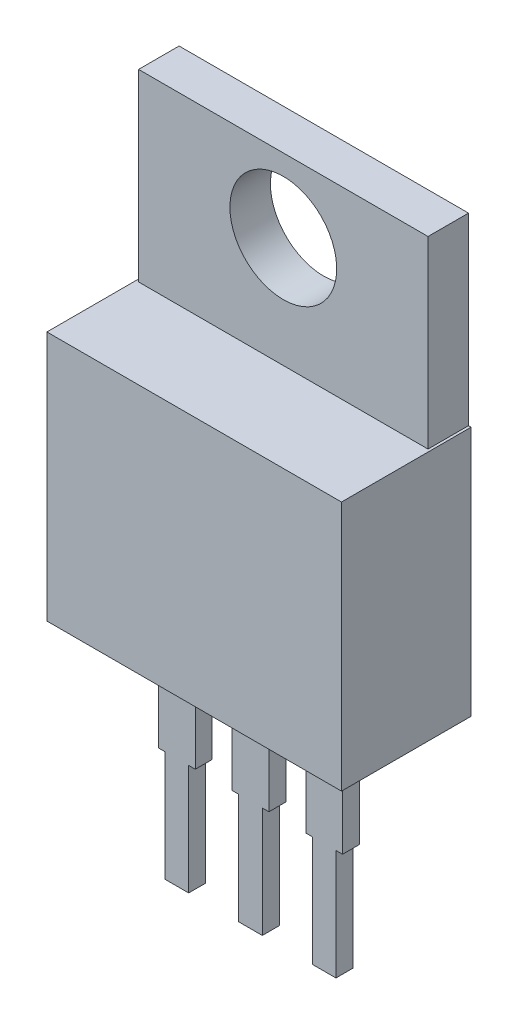
ISO-10303-21;
HEADER;
FILE_DESCRIPTION(('STEP AP214'),'2;1');
FILE_NAME('part.step','',(''),(''),'','','');
FILE_SCHEMA(('AUTOMOTIVE_DESIGN { 1 0 10303 214 1 1 1 1 }'));
ENDSEC;
DATA;
#1=APPLICATION_CONTEXT('core data for automotive mechanical design processes');
#2=APPLICATION_PROTOCOL_DEFINITION('international standard','automotive_design',2000,#1);
#3=PRODUCT_CONTEXT('',#1,'mechanical');
#4=PRODUCT('Part','Part','',(#3));
#5=PRODUCT_RELATED_PRODUCT_CATEGORY('part','',(#4));
#6=PRODUCT_DEFINITION_FORMATION('','',#4);
#7=PRODUCT_DEFINITION_CONTEXT('part definition',#1,'design');
#8=PRODUCT_DEFINITION('design','',#6,#7);
#9=PRODUCT_DEFINITION_SHAPE('','',#8);
#10=(LENGTH_UNIT() NAMED_UNIT(*) SI_UNIT(.MILLI.,.METRE.));
#11=(NAMED_UNIT(*) PLANE_ANGLE_UNIT() SI_UNIT($,.RADIAN.));
#12=(NAMED_UNIT(*) SI_UNIT($,.STERADIAN.) SOLID_ANGLE_UNIT());
#13=UNCERTAINTY_MEASURE_WITH_UNIT(LENGTH_MEASURE(1.E-05),#10,'distance_accuracy_value','');
#14=(GEOMETRIC_REPRESENTATION_CONTEXT(3) GLOBAL_UNCERTAINTY_ASSIGNED_CONTEXT((#13)) GLOBAL_UNIT_ASSIGNED_CONTEXT((#10,
#11,#12)) REPRESENTATION_CONTEXT('',''));
#15=CARTESIAN_POINT('',(0.,0.,0.));
#16=DIRECTION('',(0.,0.,1.));
#17=DIRECTION('',(1.,0.,0.));
#18=AXIS2_PLACEMENT_3D('',#15,#16,#17);
#19=CARTESIAN_POINT('',(-5.49021000000003,8.3185,1.397));
#20=DIRECTION('',(0.,0.,1.));
#21=DIRECTION('',(1.,0.,0.));
#22=AXIS2_PLACEMENT_3D('',#19,#20,#21);
#23=PLANE('',#22);
#24=CARTESIAN_POINT('',(0.,12.446,1.397));
#25=DIRECTION('',(0.,0.,1.));
#26=DIRECTION('',(0.,-1.,0.));
#27=AXIS2_PLACEMENT_3D('',#24,#25,#26);
#28=CIRCLE('',#27,1.8415);
#29=CARTESIAN_POINT('',(0.,10.6045,1.397));
#30=VERTEX_POINT('',#29);
#31=EDGE_CURVE('E21',#30,#30,#28,.T.);
#32=ORIENTED_EDGE('',*,*,#31,.F.);
#33=EDGE_LOOP('',(#32));
#34=FACE_BOUND('',#33,.T.);
#35=DIRECTION('',(1.,0.,0.));
#36=VECTOR('',#35,1.);
#37=CARTESIAN_POINT('',(-5.588,8.636,1.397));
#38=LINE('',#37,#36);
#39=CARTESIAN_POINT('',(4.9911,8.636,1.397));
#40=VERTEX_POINT('',#39);
#41=CARTESIAN_POINT('',(-4.99110000000001,8.636,1.397));
#42=VERTEX_POINT('',#41);
#43=EDGE_CURVE('E311',#40,#42,#38,.F.);
#44=ORIENTED_EDGE('',*,*,#43,.F.);
#45=DIRECTION('',(0.,1.,0.));
#46=VECTOR('',#45,1.);
#47=CARTESIAN_POINT('',(4.9911,8.3185,1.397));
#48=LINE('',#47,#46);
#49=CARTESIAN_POINT('',(4.99109999999999,14.986,1.397));
#50=VERTEX_POINT('',#49);
#51=EDGE_CURVE('E296',#50,#40,#48,.F.);
#52=ORIENTED_EDGE('',*,*,#51,.F.);
#53=DIRECTION('',(1.,0.,0.));
#54=VECTOR('',#53,1.);
#55=CARTESIAN_POINT('',(-5.49021000000003,14.986,1.397));
#56=LINE('',#55,#54);
#57=CARTESIAN_POINT('',(-4.99110000000001,14.986,1.397));
#58=VERTEX_POINT('',#57);
#59=EDGE_CURVE('E295',#58,#50,#56,.T.);
#60=ORIENTED_EDGE('',*,*,#59,.F.);
#61=DIRECTION('',(0.,1.,0.));
#62=VECTOR('',#61,1.);
#63=CARTESIAN_POINT('',(-4.9911,8.3185,1.397));
#64=LINE('',#63,#62);
#65=EDGE_CURVE('E281',#42,#58,#64,.T.);
#66=ORIENTED_EDGE('',*,*,#65,.F.);
#67=EDGE_LOOP('',(#44,#52,#60,#66));
#68=FACE_BOUND('',#67,.T.);
#69=ADVANCED_FACE('F17',(#34,#68),#23,.T.);
#70=CARTESIAN_POINT('',(0.698500000000008,-8.001,1.9431));
#71=DIRECTION('',(0.,0.,-1.));
#72=DIRECTION('',(-1.,0.,0.));
#73=AXIS2_PLACEMENT_3D('',#70,#71,#72);
#74=PLANE('',#73);
#75=DIRECTION('',(-1.,0.,0.));
#76=VECTOR('',#75,1.);
#77=CARTESIAN_POINT('',(0.698500000000008,0.,1.9431));
#78=LINE('',#77,#76);
#79=CARTESIAN_POINT('',(-0.634999999999994,0.,1.9431));
#80=VERTEX_POINT('',#79);
#81=CARTESIAN_POINT('',(0.635000000000005,0.,1.9431));
#82=VERTEX_POINT('',#81);
#83=EDGE_CURVE('E814',#80,#82,#78,.F.);
#84=ORIENTED_EDGE('',*,*,#83,.T.);
#85=DIRECTION('',(0.,1.,0.));
#86=VECTOR('',#85,1.);
#87=CARTESIAN_POINT('',(0.635000000000005,-4.0005,1.9431));
#88=LINE('',#87,#86);
#89=CARTESIAN_POINT('',(0.635000000000006,-3.81,1.9431));
#90=VERTEX_POINT('',#89);
#91=EDGE_CURVE('E340',#90,#82,#88,.T.);
#92=ORIENTED_EDGE('',*,*,#91,.F.);
#93=DIRECTION('',(1.,0.,0.));
#94=VECTOR('',#93,1.);
#95=CARTESIAN_POINT('',(0.39497000000001,-3.81,1.9431));
#96=LINE('',#95,#94);
#97=CARTESIAN_POINT('',(0.40640000000001,-3.81,1.9431));
#98=VERTEX_POINT('',#97);
#99=EDGE_CURVE('E333',#98,#90,#96,.T.);
#100=ORIENTED_EDGE('',*,*,#99,.F.);
#101=DIRECTION('',(0.,1.,0.));
#102=VECTOR('',#101,1.);
#103=CARTESIAN_POINT('',(0.40640000000001,-7.8105,1.9431));
#104=LINE('',#103,#102);
#105=CARTESIAN_POINT('',(0.406400000000011,-7.62,1.9431));
#106=VERTEX_POINT('',#105);
#107=EDGE_CURVE('E328',#106,#98,#104,.T.);
#108=ORIENTED_EDGE('',*,*,#107,.F.);
#109=DIRECTION('',(1.,0.,0.));
#110=VECTOR('',#109,1.);
#111=CARTESIAN_POINT('',(-0.447039999999987,-7.62,1.9431));
#112=LINE('',#111,#110);
#113=CARTESIAN_POINT('',(-0.40639999999999,-7.62,1.9431));
#114=VERTEX_POINT('',#113);
#115=EDGE_CURVE('E323',#114,#106,#112,.T.);
#116=ORIENTED_EDGE('',*,*,#115,.F.);
#117=DIRECTION('',(0.,1.,0.));
#118=VECTOR('',#117,1.);
#119=CARTESIAN_POINT('',(-0.406399999999992,-7.8105,1.9431));
#120=LINE('',#119,#118);
#121=CARTESIAN_POINT('',(-0.406399999999991,-3.81,1.9431));
#122=VERTEX_POINT('',#121);
#123=EDGE_CURVE('E318',#122,#114,#120,.F.);
#124=ORIENTED_EDGE('',*,*,#123,.F.);
#125=DIRECTION('',(1.,0.,0.));
#126=VECTOR('',#125,1.);
#127=CARTESIAN_POINT('',(-0.646429999999992,-3.81,1.9431));
#128=LINE('',#127,#126);
#129=CARTESIAN_POINT('',(-0.634999999999993,-3.81,1.9431));
#130=VERTEX_POINT('',#129);
#131=EDGE_CURVE('E310',#130,#122,#128,.T.);
#132=ORIENTED_EDGE('',*,*,#131,.F.);
#133=DIRECTION('',(0.,1.,0.));
#134=VECTOR('',#133,1.);
#135=CARTESIAN_POINT('',(-0.634999999999995,-4.0005,1.9431));
#136=LINE('',#135,#134);
#137=EDGE_CURVE('E344',#80,#130,#136,.F.);
#138=ORIENTED_EDGE('',*,*,#137,.F.);
#139=EDGE_LOOP('',(#84,#92,#100,#108,#116,#124,#132,#138));
#140=FACE_BOUND('',#139,.T.);
#141=ADVANCED_FACE('F651',(#140),#74,.T.);
#142=CARTESIAN_POINT('',(-1.84149999999999,-8.001,1.9431));
#143=DIRECTION('',(0.,0.,-1.));
#144=DIRECTION('',(-1.,0.,0.));
#145=AXIS2_PLACEMENT_3D('',#142,#143,#144);
#146=PLANE('',#145);
#147=DIRECTION('',(-1.,0.,0.));
#148=VECTOR('',#147,1.);
#149=CARTESIAN_POINT('',(-1.84149999999999,0.,1.9431));
#150=LINE('',#149,#148);
#151=CARTESIAN_POINT('',(-3.175,0.,1.9431));
#152=VERTEX_POINT('',#151);
#153=CARTESIAN_POINT('',(-1.905,0.,1.9431));
#154=VERTEX_POINT('',#153);
#155=EDGE_CURVE('E292',#152,#154,#150,.F.);
#156=ORIENTED_EDGE('',*,*,#155,.T.);
#157=DIRECTION('',(0.,1.,0.));
#158=VECTOR('',#157,1.);
#159=CARTESIAN_POINT('',(-1.905,-4.0005,1.9431));
#160=LINE('',#159,#158);
#161=CARTESIAN_POINT('',(-1.90499999999999,-3.81,1.9431));
#162=VERTEX_POINT('',#161);
#163=EDGE_CURVE('E376',#162,#154,#160,.T.);
#164=ORIENTED_EDGE('',*,*,#163,.F.);
#165=DIRECTION('',(1.,0.,0.));
#166=VECTOR('',#165,1.);
#167=CARTESIAN_POINT('',(-2.14502999999999,-3.81,1.9431));
#168=LINE('',#167,#166);
#169=CARTESIAN_POINT('',(-2.13359999999999,-3.81,1.9431));
#170=VERTEX_POINT('',#169);
#171=EDGE_CURVE('E369',#170,#162,#168,.T.);
#172=ORIENTED_EDGE('',*,*,#171,.F.);
#173=DIRECTION('',(0.,1.,0.));
#174=VECTOR('',#173,1.);
#175=CARTESIAN_POINT('',(-2.13359999999999,-7.8105,1.9431));
#176=LINE('',#175,#174);
#177=CARTESIAN_POINT('',(-2.13359999999999,-7.62,1.9431));
#178=VERTEX_POINT('',#177);
#179=EDGE_CURVE('E364',#178,#170,#176,.T.);
#180=ORIENTED_EDGE('',*,*,#179,.F.);
#181=DIRECTION('',(1.,0.,0.));
#182=VECTOR('',#181,1.);
#183=CARTESIAN_POINT('',(-2.98704,-7.62,1.9431));
#184=LINE('',#183,#182);
#185=CARTESIAN_POINT('',(-2.9464,-7.62,1.9431));
#186=VERTEX_POINT('',#185);
#187=EDGE_CURVE('E359',#186,#178,#184,.T.);
#188=ORIENTED_EDGE('',*,*,#187,.F.);
#189=DIRECTION('',(0.,1.,0.));
#190=VECTOR('',#189,1.);
#191=CARTESIAN_POINT('',(-2.9464,-7.8105,1.9431));
#192=LINE('',#191,#190);
#193=CARTESIAN_POINT('',(-2.9464,-3.81,1.9431));
#194=VERTEX_POINT('',#193);
#195=EDGE_CURVE('E354',#194,#186,#192,.F.);
#196=ORIENTED_EDGE('',*,*,#195,.F.);
#197=DIRECTION('',(1.,0.,0.));
#198=VECTOR('',#197,1.);
#199=CARTESIAN_POINT('',(-3.18643,-3.81,1.9431));
#200=LINE('',#199,#198);
#201=CARTESIAN_POINT('',(-3.175,-3.81,1.9431));
#202=VERTEX_POINT('',#201);
#203=EDGE_CURVE('E347',#202,#194,#200,.T.);
#204=ORIENTED_EDGE('',*,*,#203,.F.);
#205=DIRECTION('',(0.,1.,0.));
#206=VECTOR('',#205,1.);
#207=CARTESIAN_POINT('',(-3.175,-4.0005,1.9431));
#208=LINE('',#207,#206);
#209=EDGE_CURVE('E380',#152,#202,#208,.F.);
#210=ORIENTED_EDGE('',*,*,#209,.F.);
#211=EDGE_LOOP('',(#156,#164,#172,#180,#188,#196,#204,#210));
#212=FACE_BOUND('',#211,.T.);
#213=ADVANCED_FACE('F648',(#212),#146,.T.);
#214=CARTESIAN_POINT('',(-4.9911,8.3185,-0.0698499999999995));
#215=DIRECTION('',(-1.,0.,0.));
#216=DIRECTION('',(0.,0.,1.));
#217=AXIS2_PLACEMENT_3D('',#214,#215,#216);
#218=PLANE('',#217);
#219=DIRECTION('',(0.,0.,1.));
#220=VECTOR('',#219,1.);
#221=CARTESIAN_POINT('',(-4.9911,8.636,-0.223520000000001));
#222=LINE('',#221,#220);
#223=CARTESIAN_POINT('',(-4.9911,8.636,0.));
#224=VERTEX_POINT('',#223);
#225=EDGE_CURVE('E288',#42,#224,#222,.F.);
#226=ORIENTED_EDGE('',*,*,#225,.F.);
#227=ORIENTED_EDGE('',*,*,#65,.T.);
#228=DIRECTION('',(0.,0.,1.));
#229=VECTOR('',#228,1.);
#230=CARTESIAN_POINT('',(-4.99110000000003,14.986,-0.0698500000000013));
#231=LINE('',#230,#229);
#232=CARTESIAN_POINT('',(-4.99110000000001,14.986,0.));
#233=VERTEX_POINT('',#232);
#234=EDGE_CURVE('E286',#233,#58,#231,.T.);
#235=ORIENTED_EDGE('',*,*,#234,.F.);
#236=DIRECTION('',(0.,1.,0.));
#237=VECTOR('',#236,1.);
#238=CARTESIAN_POINT('',(-4.9911,-0.749300000000005,0.));
#239=LINE('',#238,#237);
#240=EDGE_CURVE('E402',#224,#233,#239,.T.);
#241=ORIENTED_EDGE('',*,*,#240,.F.);
#242=EDGE_LOOP('',(#226,#227,#235,#241));
#243=FACE_BOUND('',#242,.T.);
#244=ADVANCED_FACE('F283',(#243),#218,.T.);
#245=CARTESIAN_POINT('',(-5.49021000000003,14.986,-0.0698500000000013));
#246=DIRECTION('',(0.,1.,0.));
#247=DIRECTION('',(0.,0.,1.));
#248=AXIS2_PLACEMENT_3D('',#245,#246,#247);
#249=PLANE('',#248);
#250=DIRECTION('',(0.,0.,-1.));
#251=VECTOR('',#250,1.);
#252=CARTESIAN_POINT('',(4.9911,14.986,1.46685));
#253=LINE('',#252,#251);
#254=CARTESIAN_POINT('',(4.99109999999998,14.986,0.));
#255=VERTEX_POINT('',#254);
#256=EDGE_CURVE('E299',#255,#50,#253,.F.);
#257=ORIENTED_EDGE('',*,*,#256,.F.);
#258=DIRECTION('',(-1.,0.,0.));
#259=VECTOR('',#258,1.);
#260=CARTESIAN_POINT('',(5.588,14.986,0.));
#261=LINE('',#260,#259);
#262=EDGE_CURVE('E303',#233,#255,#261,.F.);
#263=ORIENTED_EDGE('',*,*,#262,.F.);
#264=ORIENTED_EDGE('',*,*,#234,.T.);
#265=ORIENTED_EDGE('',*,*,#59,.T.);
#266=EDGE_LOOP('',(#257,#263,#264,#265));
#267=FACE_BOUND('',#266,.T.);
#268=ADVANCED_FACE('F301',(#267),#249,.T.);
#269=CARTESIAN_POINT('',(4.9911,8.3185,1.46685));
#270=DIRECTION('',(1.,0.,0.));
#271=DIRECTION('',(0.,0.,-1.));
#272=AXIS2_PLACEMENT_3D('',#269,#270,#271);
#273=PLANE('',#272);
#274=DIRECTION('',(0.,0.,1.));
#275=VECTOR('',#274,1.);
#276=CARTESIAN_POINT('',(4.9911,8.636,-0.223520000000001));
#277=LINE('',#276,#275);
#278=CARTESIAN_POINT('',(4.9911,8.636,0.));
#279=VERTEX_POINT('',#278);
#280=EDGE_CURVE('E313',#279,#40,#277,.T.);
#281=ORIENTED_EDGE('',*,*,#280,.F.);
#282=DIRECTION('',(0.,1.,0.));
#283=VECTOR('',#282,1.);
#284=CARTESIAN_POINT('',(4.99109999999998,-0.749300000000005,0.));
#285=LINE('',#284,#283);
#286=EDGE_CURVE('E399',#255,#279,#285,.F.);
#287=ORIENTED_EDGE('',*,*,#286,.F.);
#288=ORIENTED_EDGE('',*,*,#256,.T.);
#289=ORIENTED_EDGE('',*,*,#51,.T.);
#290=EDGE_LOOP('',(#281,#287,#288,#289));
#291=FACE_BOUND('',#290,.T.);
#292=ADVANCED_FACE('F522',(#291),#273,.T.);
#293=CARTESIAN_POINT('',(0.,12.446,0.));
#294=DIRECTION('',(0.,0.,1.));
#295=DIRECTION('',(0.,-1.,0.));
#296=AXIS2_PLACEMENT_3D('',#293,#294,#295);
#297=CYLINDRICAL_SURFACE('',#296,1.8415);
#298=ORIENTED_EDGE('',*,*,#31,.T.);
#299=EDGE_LOOP('',(#298));
#300=FACE_BOUND('',#299,.T.);
#301=CARTESIAN_POINT('',(0.,12.446,0.));
#302=DIRECTION('',(0.,0.,1.));
#303=DIRECTION('',(0.,-1.,0.));
#304=AXIS2_PLACEMENT_3D('',#301,#302,#303);
#305=CIRCLE('',#304,1.8415);
#306=CARTESIAN_POINT('',(0.,10.6045,0.));
#307=VERTEX_POINT('',#306);
#308=EDGE_CURVE('E397',#307,#307,#305,.T.);
#309=ORIENTED_EDGE('',*,*,#308,.F.);
#310=EDGE_LOOP('',(#309));
#311=FACE_BOUND('',#310,.T.);
#312=ADVANCED_FACE('F19',(#300,#311),#297,.F.);
#313=CARTESIAN_POINT('',(-5.588,8.636,-0.223520000000001));
#314=DIRECTION('',(0.,1.,0.));
#315=DIRECTION('',(0.,0.,1.));
#316=AXIS2_PLACEMENT_3D('',#313,#314,#315);
#317=PLANE('',#316);
#318=DIRECTION('',(0.,0.,-1.));
#319=VECTOR('',#318,1.);
#320=CARTESIAN_POINT('',(5.08,8.636,4.69392));
#321=LINE('',#320,#319);
#322=CARTESIAN_POINT('',(5.08,8.636,0.));
#323=VERTEX_POINT('',#322);
#324=CARTESIAN_POINT('',(5.08,8.636,4.4704));
#325=VERTEX_POINT('',#324);
#326=EDGE_CURVE('E406',#323,#325,#321,.F.);
#327=ORIENTED_EDGE('',*,*,#326,.F.);
#328=DIRECTION('',(-1.,0.,0.));
#329=VECTOR('',#328,1.);
#330=CARTESIAN_POINT('',(5.588,8.636,0.));
#331=LINE('',#330,#329);
#332=EDGE_CURVE('E201',#279,#323,#331,.F.);
#333=ORIENTED_EDGE('',*,*,#332,.F.);
#334=ORIENTED_EDGE('',*,*,#280,.T.);
#335=ORIENTED_EDGE('',*,*,#43,.T.);
#336=ORIENTED_EDGE('',*,*,#225,.T.);
#337=DIRECTION('',(-1.,0.,0.));
#338=VECTOR('',#337,1.);
#339=CARTESIAN_POINT('',(5.588,8.636,0.));
#340=LINE('',#339,#338);
#341=CARTESIAN_POINT('',(-5.08,8.636,0.));
#342=VERTEX_POINT('',#341);
#343=EDGE_CURVE('E391',#342,#224,#340,.F.);
#344=ORIENTED_EDGE('',*,*,#343,.F.);
#345=DIRECTION('',(0.,0.,1.));
#346=VECTOR('',#345,1.);
#347=CARTESIAN_POINT('',(-5.08,8.636,-0.22352));
#348=LINE('',#347,#346);
#349=CARTESIAN_POINT('',(-5.08,8.636,4.4704));
#350=VERTEX_POINT('',#349);
#351=EDGE_CURVE('E388',#350,#342,#348,.F.);
#352=ORIENTED_EDGE('',*,*,#351,.F.);
#353=DIRECTION('',(1.,0.,0.));
#354=VECTOR('',#353,1.);
#355=CARTESIAN_POINT('',(-5.588,8.636,4.4704));
#356=LINE('',#355,#354);
#357=EDGE_CURVE('E383',#325,#350,#356,.F.);
#358=ORIENTED_EDGE('',*,*,#357,.F.);
#359=EDGE_LOOP('',(#327,#333,#334,#335,#336,#344,#352,#358));
#360=FACE_BOUND('',#359,.T.);
#361=ADVANCED_FACE('F521',(#360),#317,.T.);
#362=CARTESIAN_POINT('',(-0.646429999999992,-3.81,2.55651));
#363=DIRECTION('',(0.,-1.,0.));
#364=DIRECTION('',(0.,0.,-1.));
#365=AXIS2_PLACEMENT_3D('',#362,#363,#364);
#366=PLANE('',#365);
#367=DIRECTION('',(0.,0.,1.));
#368=VECTOR('',#367,1.);
#369=CARTESIAN_POINT('',(-0.634999999999995,-3.81,1.91389));
#370=LINE('',#369,#368);
#371=CARTESIAN_POINT('',(-0.634999999999994,-3.81,2.5273));
#372=VERTEX_POINT('',#371);
#373=EDGE_CURVE('E339',#130,#372,#370,.T.);
#374=ORIENTED_EDGE('',*,*,#373,.F.);
#375=ORIENTED_EDGE('',*,*,#131,.T.);
#376=DIRECTION('',(0.,0.,1.));
#377=VECTOR('',#376,1.);
#378=CARTESIAN_POINT('',(-0.406399999999992,-3.81,1.91389));
#379=LINE('',#378,#377);
#380=CARTESIAN_POINT('',(-0.406399999999992,-3.81,2.5273));
#381=VERTEX_POINT('',#380);
#382=EDGE_CURVE('E317',#381,#122,#379,.F.);
#383=ORIENTED_EDGE('',*,*,#382,.F.);
#384=DIRECTION('',(1.,0.,0.));
#385=VECTOR('',#384,1.);
#386=CARTESIAN_POINT('',(-0.698499999999995,-3.81,2.5273));
#387=LINE('',#386,#385);
#388=EDGE_CURVE('E195',#372,#381,#387,.T.);
#389=ORIENTED_EDGE('',*,*,#388,.F.);
#390=EDGE_LOOP('',(#374,#375,#383,#389));
#391=FACE_BOUND('',#390,.T.);
#392=ADVANCED_FACE('F529',(#391),#366,.T.);
#393=CARTESIAN_POINT('',(-0.406399999999992,-7.8105,1.91389));
#394=DIRECTION('',(-1.,0.,0.));
#395=DIRECTION('',(0.,0.,1.));
#396=AXIS2_PLACEMENT_3D('',#393,#394,#395);
#397=PLANE('',#396);
#398=ORIENTED_EDGE('',*,*,#382,.T.);
#399=ORIENTED_EDGE('',*,*,#123,.T.);
#400=DIRECTION('',(0.,0.,-1.));
#401=VECTOR('',#400,1.);
#402=CARTESIAN_POINT('',(-0.406399999999987,-7.62,2.55651));
#403=LINE('',#402,#401);
#404=CARTESIAN_POINT('',(-0.406399999999991,-7.62,2.5273));
#405=VERTEX_POINT('',#404);
#406=EDGE_CURVE('E320',#405,#114,#403,.T.);
#407=ORIENTED_EDGE('',*,*,#406,.F.);
#408=DIRECTION('',(0.,1.,0.));
#409=VECTOR('',#408,1.);
#410=CARTESIAN_POINT('',(-0.406399999999992,-8.001,2.5273));
#411=LINE('',#410,#409);
#412=EDGE_CURVE('E429',#381,#405,#411,.F.);
#413=ORIENTED_EDGE('',*,*,#412,.F.);
#414=EDGE_LOOP('',(#398,#399,#407,#413));
#415=FACE_BOUND('',#414,.T.);
#416=ADVANCED_FACE('F637',(#415),#397,.T.);
#417=CARTESIAN_POINT('',(-0.447039999999987,-7.62,2.55651));
#418=DIRECTION('',(0.,-1.,0.));
#419=DIRECTION('',(0.,0.,-1.));
#420=AXIS2_PLACEMENT_3D('',#417,#418,#419);
#421=PLANE('',#420);
#422=ORIENTED_EDGE('',*,*,#115,.T.);
#423=DIRECTION('',(0.,0.,-1.));
#424=VECTOR('',#423,1.);
#425=CARTESIAN_POINT('',(0.40640000000001,-7.62,2.55651));
#426=LINE('',#425,#424);
#427=CARTESIAN_POINT('',(0.406400000000012,-7.62,2.5273));
#428=VERTEX_POINT('',#427);
#429=EDGE_CURVE('E325',#428,#106,#426,.T.);
#430=ORIENTED_EDGE('',*,*,#429,.F.);
#431=DIRECTION('',(1.,0.,0.));
#432=VECTOR('',#431,1.);
#433=CARTESIAN_POINT('',(-0.698499999999995,-7.62,2.5273));
#434=LINE('',#433,#432);
#435=EDGE_CURVE('E426',#405,#428,#434,.T.);
#436=ORIENTED_EDGE('',*,*,#435,.F.);
#437=ORIENTED_EDGE('',*,*,#406,.T.);
#438=EDGE_LOOP('',(#422,#430,#436,#437));
#439=FACE_BOUND('',#438,.T.);
#440=ADVANCED_FACE('F633',(#439),#421,.T.);
#441=CARTESIAN_POINT('',(0.40640000000001,-7.8105,2.55651));
#442=DIRECTION('',(1.,0.,0.));
#443=DIRECTION('',(0.,0.,-1.));
#444=AXIS2_PLACEMENT_3D('',#441,#442,#443);
#445=PLANE('',#444);
#446=DIRECTION('',(0.,0.,-1.));
#447=VECTOR('',#446,1.);
#448=CARTESIAN_POINT('',(0.40640000000001,-3.81,2.55651));
#449=LINE('',#448,#447);
#450=CARTESIAN_POINT('',(0.406400000000011,-3.81,2.5273));
#451=VERTEX_POINT('',#450);
#452=EDGE_CURVE('E330',#451,#98,#449,.T.);
#453=ORIENTED_EDGE('',*,*,#452,.F.);
#454=DIRECTION('',(0.,1.,0.));
#455=VECTOR('',#454,1.);
#456=CARTESIAN_POINT('',(0.406400000000013,-8.001,2.5273));
#457=LINE('',#456,#455);
#458=EDGE_CURVE('E423',#428,#451,#457,.T.);
#459=ORIENTED_EDGE('',*,*,#458,.F.);
#460=ORIENTED_EDGE('',*,*,#429,.T.);
#461=ORIENTED_EDGE('',*,*,#107,.T.);
#462=EDGE_LOOP('',(#453,#459,#460,#461));
#463=FACE_BOUND('',#462,.T.);
#464=ADVANCED_FACE('F630',(#463),#445,.T.);
#465=CARTESIAN_POINT('',(0.39497000000001,-3.81,2.55651));
#466=DIRECTION('',(0.,-1.,0.));
#467=DIRECTION('',(0.,0.,-1.));
#468=AXIS2_PLACEMENT_3D('',#465,#466,#467);
#469=PLANE('',#468);
#470=DIRECTION('',(0.,0.,-1.));
#471=VECTOR('',#470,1.);
#472=CARTESIAN_POINT('',(0.635000000000005,-3.81,2.55651));
#473=LINE('',#472,#471);
#474=CARTESIAN_POINT('',(0.635000000000007,-3.81,2.5273));
#475=VERTEX_POINT('',#474);
#476=EDGE_CURVE('E175',#475,#90,#473,.T.);
#477=ORIENTED_EDGE('',*,*,#476,.F.);
#478=DIRECTION('',(1.,0.,0.));
#479=VECTOR('',#478,1.);
#480=CARTESIAN_POINT('',(-0.698499999999995,-3.81,2.5273));
#481=LINE('',#480,#479);
#482=EDGE_CURVE('E420',#451,#475,#481,.T.);
#483=ORIENTED_EDGE('',*,*,#482,.F.);
#484=ORIENTED_EDGE('',*,*,#452,.T.);
#485=ORIENTED_EDGE('',*,*,#99,.T.);
#486=EDGE_LOOP('',(#477,#483,#484,#485));
#487=FACE_BOUND('',#486,.T.);
#488=ADVANCED_FACE('F626',(#487),#469,.T.);
#489=CARTESIAN_POINT('',(0.635000000000005,-4.0005,2.55651));
#490=DIRECTION('',(1.,0.,0.));
#491=DIRECTION('',(0.,0.,-1.));
#492=AXIS2_PLACEMENT_3D('',#489,#490,#491);
#493=PLANE('',#492);
#494=DIRECTION('',(0.,0.,-1.));
#495=VECTOR('',#494,1.);
#496=CARTESIAN_POINT('',(0.635000000000005,0.,2.55651));
#497=LINE('',#496,#495);
#498=CARTESIAN_POINT('',(0.635000000000006,0.,2.5273));
#499=VERTEX_POINT('',#498);
#500=EDGE_CURVE('E337',#82,#499,#497,.F.);
#501=ORIENTED_EDGE('',*,*,#500,.T.);
#502=DIRECTION('',(0.,1.,0.));
#503=VECTOR('',#502,1.);
#504=CARTESIAN_POINT('',(0.635000000000008,-8.001,2.5273));
#505=LINE('',#504,#503);
#506=EDGE_CURVE('E417',#475,#499,#505,.T.);
#507=ORIENTED_EDGE('',*,*,#506,.F.);
#508=ORIENTED_EDGE('',*,*,#476,.T.);
#509=ORIENTED_EDGE('',*,*,#91,.T.);
#510=EDGE_LOOP('',(#501,#507,#508,#509));
#511=FACE_BOUND('',#510,.T.);
#512=ADVANCED_FACE('F622',(#511),#493,.T.);
#513=CARTESIAN_POINT('',(-0.634999999999995,-4.0005,1.91389));
#514=DIRECTION('',(-1.,0.,0.));
#515=DIRECTION('',(0.,0.,1.));
#516=AXIS2_PLACEMENT_3D('',#513,#514,#515);
#517=PLANE('',#516);
#518=DIRECTION('',(0.,0.,1.));
#519=VECTOR('',#518,1.);
#520=CARTESIAN_POINT('',(-0.634999999999995,0.,1.91389));
#521=LINE('',#520,#519);
#522=CARTESIAN_POINT('',(-0.634999999999995,0.,2.5273));
#523=VERTEX_POINT('',#522);
#524=EDGE_CURVE('E348',#523,#80,#521,.F.);
#525=ORIENTED_EDGE('',*,*,#524,.T.);
#526=ORIENTED_EDGE('',*,*,#137,.T.);
#527=ORIENTED_EDGE('',*,*,#373,.T.);
#528=DIRECTION('',(0.,1.,0.));
#529=VECTOR('',#528,1.);
#530=CARTESIAN_POINT('',(-0.634999999999995,-8.001,2.5273));
#531=LINE('',#530,#529);
#532=EDGE_CURVE('E414',#523,#372,#531,.F.);
#533=ORIENTED_EDGE('',*,*,#532,.F.);
#534=EDGE_LOOP('',(#525,#526,#527,#533));
#535=FACE_BOUND('',#534,.T.);
#536=ADVANCED_FACE('F619',(#535),#517,.T.);
#537=CARTESIAN_POINT('',(-3.18643,-3.81,2.55651));
#538=DIRECTION('',(0.,-1.,0.));
#539=DIRECTION('',(0.,0.,-1.));
#540=AXIS2_PLACEMENT_3D('',#537,#538,#539);
#541=PLANE('',#540);
#542=DIRECTION('',(0.,0.,1.));
#543=VECTOR('',#542,1.);
#544=CARTESIAN_POINT('',(-3.175,-3.81,1.91389));
#545=LINE('',#544,#543);
#546=CARTESIAN_POINT('',(-3.175,-3.81,2.5273));
#547=VERTEX_POINT('',#546);
#548=EDGE_CURVE('E375',#202,#547,#545,.T.);
#549=ORIENTED_EDGE('',*,*,#548,.F.);
#550=ORIENTED_EDGE('',*,*,#203,.T.);
#551=DIRECTION('',(0.,0.,1.));
#552=VECTOR('',#551,1.);
#553=CARTESIAN_POINT('',(-2.9464,-3.81,1.91389));
#554=LINE('',#553,#552);
#555=CARTESIAN_POINT('',(-2.9464,-3.81,2.5273));
#556=VERTEX_POINT('',#555);
#557=EDGE_CURVE('E353',#556,#194,#554,.F.);
#558=ORIENTED_EDGE('',*,*,#557,.F.);
#559=DIRECTION('',(1.,0.,0.));
#560=VECTOR('',#559,1.);
#561=CARTESIAN_POINT('',(-3.2385,-3.81,2.5273));
#562=LINE('',#561,#560);
#563=EDGE_CURVE('E166',#547,#556,#562,.T.);
#564=ORIENTED_EDGE('',*,*,#563,.F.);
#565=EDGE_LOOP('',(#549,#550,#558,#564));
#566=FACE_BOUND('',#565,.T.);
#567=ADVANCED_FACE('F615',(#566),#541,.T.);
#568=CARTESIAN_POINT('',(-2.9464,-7.8105,1.91389));
#569=DIRECTION('',(-1.,0.,0.));
#570=DIRECTION('',(0.,0.,1.));
#571=AXIS2_PLACEMENT_3D('',#568,#569,#570);
#572=PLANE('',#571);
#573=ORIENTED_EDGE('',*,*,#557,.T.);
#574=ORIENTED_EDGE('',*,*,#195,.T.);
#575=DIRECTION('',(0.,0.,-1.));
#576=VECTOR('',#575,1.);
#577=CARTESIAN_POINT('',(-2.9464,-7.62,2.55651));
#578=LINE('',#577,#576);
#579=CARTESIAN_POINT('',(-2.9464,-7.62,2.5273));
#580=VERTEX_POINT('',#579);
#581=EDGE_CURVE('E356',#580,#186,#578,.T.);
#582=ORIENTED_EDGE('',*,*,#581,.F.);
#583=DIRECTION('',(0.,1.,0.));
#584=VECTOR('',#583,1.);
#585=CARTESIAN_POINT('',(-2.9464,-8.001,2.5273));
#586=LINE('',#585,#584);
#587=EDGE_CURVE('E449',#556,#580,#586,.F.);
#588=ORIENTED_EDGE('',*,*,#587,.F.);
#589=EDGE_LOOP('',(#573,#574,#582,#588));
#590=FACE_BOUND('',#589,.T.);
#591=ADVANCED_FACE('F611',(#590),#572,.T.);
#592=CARTESIAN_POINT('',(-2.98704,-7.62,2.55651));
#593=DIRECTION('',(0.,-1.,0.));
#594=DIRECTION('',(0.,0.,-1.));
#595=AXIS2_PLACEMENT_3D('',#592,#593,#594);
#596=PLANE('',#595);
#597=ORIENTED_EDGE('',*,*,#187,.T.);
#598=DIRECTION('',(0.,0.,-1.));
#599=VECTOR('',#598,1.);
#600=CARTESIAN_POINT('',(-2.13359999999999,-7.62,2.55651));
#601=LINE('',#600,#599);
#602=CARTESIAN_POINT('',(-2.13359999999999,-7.62,2.5273));
#603=VERTEX_POINT('',#602);
#604=EDGE_CURVE('E361',#603,#178,#601,.T.);
#605=ORIENTED_EDGE('',*,*,#604,.F.);
#606=DIRECTION('',(1.,0.,0.));
#607=VECTOR('',#606,1.);
#608=CARTESIAN_POINT('',(-3.2385,-7.62,2.5273));
#609=LINE('',#608,#607);
#610=EDGE_CURVE('E446',#580,#603,#609,.T.);
#611=ORIENTED_EDGE('',*,*,#610,.F.);
#612=ORIENTED_EDGE('',*,*,#581,.T.);
#613=EDGE_LOOP('',(#597,#605,#611,#612));
#614=FACE_BOUND('',#613,.T.);
#615=ADVANCED_FACE('F607',(#614),#596,.T.);
#616=CARTESIAN_POINT('',(-2.13359999999999,-7.8105,2.55651));
#617=DIRECTION('',(1.,0.,0.));
#618=DIRECTION('',(0.,0.,-1.));
#619=AXIS2_PLACEMENT_3D('',#616,#617,#618);
#620=PLANE('',#619);
#621=DIRECTION('',(0.,0.,-1.));
#622=VECTOR('',#621,1.);
#623=CARTESIAN_POINT('',(-2.13359999999999,-3.81,2.55651));
#624=LINE('',#623,#622);
#625=CARTESIAN_POINT('',(-2.13359999999999,-3.81,2.5273));
#626=VERTEX_POINT('',#625);
#627=EDGE_CURVE('E366',#626,#170,#624,.T.);
#628=ORIENTED_EDGE('',*,*,#627,.F.);
#629=DIRECTION('',(0.,1.,0.));
#630=VECTOR('',#629,1.);
#631=CARTESIAN_POINT('',(-2.13359999999999,-8.001,2.5273));
#632=LINE('',#631,#630);
#633=EDGE_CURVE('E443',#603,#626,#632,.T.);
#634=ORIENTED_EDGE('',*,*,#633,.F.);
#635=ORIENTED_EDGE('',*,*,#604,.T.);
#636=ORIENTED_EDGE('',*,*,#179,.T.);
#637=EDGE_LOOP('',(#628,#634,#635,#636));
#638=FACE_BOUND('',#637,.T.);
#639=ADVANCED_FACE('F604',(#638),#620,.T.);
#640=CARTESIAN_POINT('',(-2.14502999999999,-3.81,2.55651));
#641=DIRECTION('',(0.,-1.,0.));
#642=DIRECTION('',(0.,0.,-1.));
#643=AXIS2_PLACEMENT_3D('',#640,#641,#642);
#644=PLANE('',#643);
#645=DIRECTION('',(0.,0.,-1.));
#646=VECTOR('',#645,1.);
#647=CARTESIAN_POINT('',(-1.905,-3.81,2.55651));
#648=LINE('',#647,#646);
#649=CARTESIAN_POINT('',(-1.90499999999999,-3.81,2.5273));
#650=VERTEX_POINT('',#649);
#651=EDGE_CURVE('E146',#650,#162,#648,.T.);
#652=ORIENTED_EDGE('',*,*,#651,.F.);
#653=DIRECTION('',(1.,0.,0.));
#654=VECTOR('',#653,1.);
#655=CARTESIAN_POINT('',(-3.2385,-3.81,2.5273));
#656=LINE('',#655,#654);
#657=EDGE_CURVE('E440',#626,#650,#656,.T.);
#658=ORIENTED_EDGE('',*,*,#657,.F.);
#659=ORIENTED_EDGE('',*,*,#627,.T.);
#660=ORIENTED_EDGE('',*,*,#171,.T.);
#661=EDGE_LOOP('',(#652,#658,#659,#660));
#662=FACE_BOUND('',#661,.T.);
#663=ADVANCED_FACE('F600',(#662),#644,.T.);
#664=CARTESIAN_POINT('',(-1.905,-4.0005,2.55651));
#665=DIRECTION('',(1.,0.,0.));
#666=DIRECTION('',(0.,0.,-1.));
#667=AXIS2_PLACEMENT_3D('',#664,#665,#666);
#668=PLANE('',#667);
#669=DIRECTION('',(0.,0.,-1.));
#670=VECTOR('',#669,1.);
#671=CARTESIAN_POINT('',(-1.905,0.,2.55651));
#672=LINE('',#671,#670);
#673=CARTESIAN_POINT('',(-1.90499999999999,0.,2.5273));
#674=VERTEX_POINT('',#673);
#675=EDGE_CURVE('E373',#154,#674,#672,.F.);
#676=ORIENTED_EDGE('',*,*,#675,.T.);
#677=DIRECTION('',(0.,1.,0.));
#678=VECTOR('',#677,1.);
#679=CARTESIAN_POINT('',(-1.90499999999999,-8.001,2.5273));
#680=LINE('',#679,#678);
#681=EDGE_CURVE('E437',#650,#674,#680,.T.);
#682=ORIENTED_EDGE('',*,*,#681,.F.);
#683=ORIENTED_EDGE('',*,*,#651,.T.);
#684=ORIENTED_EDGE('',*,*,#163,.T.);
#685=EDGE_LOOP('',(#676,#682,#683,#684));
#686=FACE_BOUND('',#685,.T.);
#687=ADVANCED_FACE('F596',(#686),#668,.T.);
#688=CARTESIAN_POINT('',(-3.175,-4.0005,1.91389));
#689=DIRECTION('',(-1.,0.,0.));
#690=DIRECTION('',(0.,0.,1.));
#691=AXIS2_PLACEMENT_3D('',#688,#689,#690);
#692=PLANE('',#691);
#693=DIRECTION('',(0.,0.,1.));
#694=VECTOR('',#693,1.);
#695=CARTESIAN_POINT('',(-3.175,0.,1.91389));
#696=LINE('',#695,#694);
#697=CARTESIAN_POINT('',(-3.175,0.,2.5273));
#698=VERTEX_POINT('',#697);
#699=EDGE_CURVE('E111',#698,#152,#696,.F.);
#700=ORIENTED_EDGE('',*,*,#699,.T.);
#701=ORIENTED_EDGE('',*,*,#209,.T.);
#702=ORIENTED_EDGE('',*,*,#548,.T.);
#703=DIRECTION('',(0.,1.,0.));
#704=VECTOR('',#703,1.);
#705=CARTESIAN_POINT('',(-3.175,-8.001,2.5273));
#706=LINE('',#705,#704);
#707=EDGE_CURVE('E433',#698,#547,#706,.F.);
#708=ORIENTED_EDGE('',*,*,#707,.F.);
#709=EDGE_LOOP('',(#700,#701,#702,#708));
#710=FACE_BOUND('',#709,.T.);
#711=ADVANCED_FACE('F593',(#710),#692,.T.);
#712=CARTESIAN_POINT('',(-5.588,-0.431800000000005,4.4704));
#713=DIRECTION('',(0.,0.,1.));
#714=DIRECTION('',(1.,0.,0.));
#715=AXIS2_PLACEMENT_3D('',#712,#713,#714);
#716=PLANE('',#715);
#717=DIRECTION('',(0.,1.,0.));
#718=VECTOR('',#717,1.);
#719=CARTESIAN_POINT('',(-5.08,-0.431800000000005,4.4704));
#720=LINE('',#719,#718);
#721=CARTESIAN_POINT('',(-5.08,0.,4.4704));
#722=VERTEX_POINT('',#721);
#723=EDGE_CURVE('E387',#722,#350,#720,.T.);
#724=ORIENTED_EDGE('',*,*,#723,.F.);
#725=DIRECTION('',(1.,0.,0.));
#726=VECTOR('',#725,1.);
#727=CARTESIAN_POINT('',(-5.588,0.,4.4704));
#728=LINE('',#727,#726);
#729=CARTESIAN_POINT('',(5.08,0.,4.4704));
#730=VERTEX_POINT('',#729);
#731=EDGE_CURVE('E137',#730,#722,#728,.F.);
#732=ORIENTED_EDGE('',*,*,#731,.F.);
#733=DIRECTION('',(0.,1.,0.));
#734=VECTOR('',#733,1.);
#735=CARTESIAN_POINT('',(5.08,-0.431799999999997,4.4704));
#736=LINE('',#735,#734);
#737=EDGE_CURVE('E412',#325,#730,#736,.F.);
#738=ORIENTED_EDGE('',*,*,#737,.F.);
#739=ORIENTED_EDGE('',*,*,#357,.T.);
#740=EDGE_LOOP('',(#724,#732,#738,#739));
#741=FACE_BOUND('',#740,.T.);
#742=ADVANCED_FACE('F589',(#741),#716,.T.);
#743=CARTESIAN_POINT('',(-5.08,-0.431800000000005,-0.22352));
#744=DIRECTION('',(-1.,0.,0.));
#745=DIRECTION('',(0.,0.,1.));
#746=AXIS2_PLACEMENT_3D('',#743,#744,#745);
#747=PLANE('',#746);
#748=DIRECTION('',(0.,1.,0.));
#749=VECTOR('',#748,1.);
#750=CARTESIAN_POINT('',(-5.08,-0.749300000000005,0.));
#751=LINE('',#750,#749);
#752=CARTESIAN_POINT('',(-5.08,0.,0.));
#753=VERTEX_POINT('',#752);
#754=EDGE_CURVE('E394',#753,#342,#751,.T.);
#755=ORIENTED_EDGE('',*,*,#754,.F.);
#756=DIRECTION('',(0.,0.,-1.));
#757=VECTOR('',#756,1.);
#758=CARTESIAN_POINT('',(-5.08,0.,4.69392));
#759=LINE('',#758,#757);
#760=EDGE_CURVE('E467',#722,#753,#759,.T.);
#761=ORIENTED_EDGE('',*,*,#760,.F.);
#762=ORIENTED_EDGE('',*,*,#723,.T.);
#763=ORIENTED_EDGE('',*,*,#351,.T.);
#764=EDGE_LOOP('',(#755,#761,#762,#763));
#765=FACE_BOUND('',#764,.T.);
#766=ADVANCED_FACE('F586',(#765),#747,.T.);
#767=CARTESIAN_POINT('',(5.588,-0.749300000000005,0.));
#768=DIRECTION('',(0.,0.,-1.));
#769=DIRECTION('',(-1.,0.,0.));
#770=AXIS2_PLACEMENT_3D('',#767,#768,#769);
#771=PLANE('',#770);
#772=ORIENTED_EDGE('',*,*,#308,.T.);
#773=EDGE_LOOP('',(#772));
#774=FACE_BOUND('',#773,.T.);
#775=DIRECTION('',(1.,0.,0.));
#776=VECTOR('',#775,1.);
#777=CARTESIAN_POINT('',(-5.588,0.,0.));
#778=LINE('',#777,#776);
#779=CARTESIAN_POINT('',(5.08,0.,0.));
#780=VERTEX_POINT('',#779);
#781=EDGE_CURVE('E464',#753,#780,#778,.T.);
#782=ORIENTED_EDGE('',*,*,#781,.F.);
#783=ORIENTED_EDGE('',*,*,#754,.T.);
#784=ORIENTED_EDGE('',*,*,#343,.T.);
#785=ORIENTED_EDGE('',*,*,#240,.T.);
#786=ORIENTED_EDGE('',*,*,#262,.T.);
#787=ORIENTED_EDGE('',*,*,#286,.T.);
#788=ORIENTED_EDGE('',*,*,#332,.T.);
#789=DIRECTION('',(0.,1.,0.));
#790=VECTOR('',#789,1.);
#791=CARTESIAN_POINT('',(5.08,-0.431799999999997,0.));
#792=LINE('',#791,#790);
#793=EDGE_CURVE('E409',#780,#323,#792,.T.);
#794=ORIENTED_EDGE('',*,*,#793,.F.);
#795=EDGE_LOOP('',(#782,#783,#784,#785,#786,#787,#788,#794));
#796=FACE_BOUND('',#795,.T.);
#797=ADVANCED_FACE('F518',(#774,#796),#771,.T.);
#798=CARTESIAN_POINT('',(5.08,-0.431799999999997,4.69392));
#799=DIRECTION('',(1.,0.,0.));
#800=DIRECTION('',(0.,0.,-1.));
#801=AXIS2_PLACEMENT_3D('',#798,#799,#800);
#802=PLANE('',#801);
#803=ORIENTED_EDGE('',*,*,#793,.T.);
#804=ORIENTED_EDGE('',*,*,#326,.T.);
#805=ORIENTED_EDGE('',*,*,#737,.T.);
#806=DIRECTION('',(0.,0.,-1.));
#807=VECTOR('',#806,1.);
#808=CARTESIAN_POINT('',(5.08,0.,4.69392));
#809=LINE('',#808,#807);
#810=EDGE_CURVE('E461',#780,#730,#809,.F.);
#811=ORIENTED_EDGE('',*,*,#810,.F.);
#812=EDGE_LOOP('',(#803,#804,#805,#811));
#813=FACE_BOUND('',#812,.T.);
#814=ADVANCED_FACE('F579',(#813),#802,.T.);
#815=CARTESIAN_POINT('',(-0.698499999999995,-8.001,2.5273));
#816=DIRECTION('',(0.,0.,1.));
#817=DIRECTION('',(1.,0.,0.));
#818=AXIS2_PLACEMENT_3D('',#815,#816,#817);
#819=PLANE('',#818);
#820=DIRECTION('',(1.,0.,0.));
#821=VECTOR('',#820,1.);
#822=CARTESIAN_POINT('',(-5.588,0.,2.5273));
#823=LINE('',#822,#821);
#824=EDGE_CURVE('E457',#523,#499,#823,.T.);
#825=ORIENTED_EDGE('',*,*,#824,.F.);
#826=ORIENTED_EDGE('',*,*,#532,.T.);
#827=ORIENTED_EDGE('',*,*,#388,.T.);
#828=ORIENTED_EDGE('',*,*,#412,.T.);
#829=ORIENTED_EDGE('',*,*,#435,.T.);
#830=ORIENTED_EDGE('',*,*,#458,.T.);
#831=ORIENTED_EDGE('',*,*,#482,.T.);
#832=ORIENTED_EDGE('',*,*,#506,.T.);
#833=EDGE_LOOP('',(#825,#826,#827,#828,#829,#830,#831,#832));
#834=FACE_BOUND('',#833,.T.);
#835=ADVANCED_FACE('F575',(#834),#819,.T.);
#836=CARTESIAN_POINT('',(-3.2385,-8.001,2.5273));
#837=DIRECTION('',(0.,0.,1.));
#838=DIRECTION('',(1.,0.,0.));
#839=AXIS2_PLACEMENT_3D('',#836,#837,#838);
#840=PLANE('',#839);
#841=DIRECTION('',(1.,0.,0.));
#842=VECTOR('',#841,1.);
#843=CARTESIAN_POINT('',(-5.588,0.,2.5273));
#844=LINE('',#843,#842);
#845=EDGE_CURVE('E454',#698,#674,#844,.T.);
#846=ORIENTED_EDGE('',*,*,#845,.F.);
#847=ORIENTED_EDGE('',*,*,#707,.T.);
#848=ORIENTED_EDGE('',*,*,#563,.T.);
#849=ORIENTED_EDGE('',*,*,#587,.T.);
#850=ORIENTED_EDGE('',*,*,#610,.T.);
#851=ORIENTED_EDGE('',*,*,#633,.T.);
#852=ORIENTED_EDGE('',*,*,#657,.T.);
#853=ORIENTED_EDGE('',*,*,#681,.T.);
#854=EDGE_LOOP('',(#846,#847,#848,#849,#850,#851,#852,#853));
#855=FACE_BOUND('',#854,.T.);
#856=ADVANCED_FACE('F572',(#855),#840,.T.);
#857=CARTESIAN_POINT('',(1.89357000000001,-3.81,2.55651));
#858=DIRECTION('',(0.,-1.,0.));
#859=DIRECTION('',(0.,0.,-1.));
#860=AXIS2_PLACEMENT_3D('',#857,#858,#859);
#861=PLANE('',#860);
#862=DIRECTION('',(0.,0.,1.));
#863=VECTOR('',#862,1.);
#864=CARTESIAN_POINT('',(1.90500000000001,-3.81,1.91389));
#865=LINE('',#864,#863);
#866=CARTESIAN_POINT('',(1.90500000000001,-3.81,1.9431));
#867=VERTEX_POINT('',#866);
#868=CARTESIAN_POINT('',(1.90500000000001,-3.81,2.5273));
#869=VERTEX_POINT('',#868);
#870=EDGE_CURVE('E456',#867,#869,#865,.T.);
#871=ORIENTED_EDGE('',*,*,#870,.F.);
#872=DIRECTION('',(-1.,0.,0.));
#873=VECTOR('',#872,1.);
#874=CARTESIAN_POINT('',(3.2385,-3.81,1.9431));
#875=LINE('',#874,#873);
#876=CARTESIAN_POINT('',(2.13360000000001,-3.81,1.9431));
#877=VERTEX_POINT('',#876);
#878=EDGE_CURVE('E482',#877,#867,#875,.T.);
#879=ORIENTED_EDGE('',*,*,#878,.F.);
#880=DIRECTION('',(0.,0.,1.));
#881=VECTOR('',#880,1.);
#882=CARTESIAN_POINT('',(2.13360000000001,-3.81,1.91389));
#883=LINE('',#882,#881);
#884=CARTESIAN_POINT('',(2.13360000000001,-3.81,2.5273));
#885=VERTEX_POINT('',#884);
#886=EDGE_CURVE('E436',#885,#877,#883,.F.);
#887=ORIENTED_EDGE('',*,*,#886,.F.);
#888=DIRECTION('',(1.,0.,0.));
#889=VECTOR('',#888,1.);
#890=CARTESIAN_POINT('',(1.84150000000001,-3.81,2.5273));
#891=LINE('',#890,#889);
#892=EDGE_CURVE('E77',#869,#885,#891,.T.);
#893=ORIENTED_EDGE('',*,*,#892,.F.);
#894=EDGE_LOOP('',(#871,#879,#887,#893));
#895=FACE_BOUND('',#894,.T.);
#896=ADVANCED_FACE('F568',(#895),#861,.T.);
#897=CARTESIAN_POINT('',(2.13360000000001,-7.8105,1.91389));
#898=DIRECTION('',(-1.,0.,0.));
#899=DIRECTION('',(0.,0.,1.));
#900=AXIS2_PLACEMENT_3D('',#897,#898,#899);
#901=PLANE('',#900);
#902=ORIENTED_EDGE('',*,*,#886,.T.);
#903=DIRECTION('',(0.,1.,0.));
#904=VECTOR('',#903,1.);
#905=CARTESIAN_POINT('',(2.13360000000001,-8.001,1.9431));
#906=LINE('',#905,#904);
#907=CARTESIAN_POINT('',(2.13360000000001,-7.62,1.9431));
#908=VERTEX_POINT('',#907);
#909=EDGE_CURVE('E485',#908,#877,#906,.T.);
#910=ORIENTED_EDGE('',*,*,#909,.F.);
#911=DIRECTION('',(0.,0.,-1.));
#912=VECTOR('',#911,1.);
#913=CARTESIAN_POINT('',(2.13360000000001,-7.62,2.55651));
#914=LINE('',#913,#912);
#915=CARTESIAN_POINT('',(2.13360000000001,-7.62,2.5273));
#916=VERTEX_POINT('',#915);
#917=EDGE_CURVE('E102',#916,#908,#914,.T.);
#918=ORIENTED_EDGE('',*,*,#917,.F.);
#919=DIRECTION('',(0.,1.,0.));
#920=VECTOR('',#919,1.);
#921=CARTESIAN_POINT('',(2.13360000000001,-8.001,2.5273));
#922=LINE('',#921,#920);
#923=EDGE_CURVE('E506',#885,#916,#922,.F.);
#924=ORIENTED_EDGE('',*,*,#923,.F.);
#925=EDGE_LOOP('',(#902,#910,#918,#924));
#926=FACE_BOUND('',#925,.T.);
#927=ADVANCED_FACE('F564',(#926),#901,.T.);
#928=CARTESIAN_POINT('',(3.175,-4.0005,2.55651));
#929=DIRECTION('',(1.,0.,0.));
#930=DIRECTION('',(0.,0.,-1.));
#931=AXIS2_PLACEMENT_3D('',#928,#929,#930);
#932=PLANE('',#931);
#933=DIRECTION('',(0.,0.,-1.));
#934=VECTOR('',#933,1.);
#935=CARTESIAN_POINT('',(3.175,0.,4.69392));
#936=LINE('',#935,#934);
#937=CARTESIAN_POINT('',(3.175,0.,2.5273));
#938=VERTEX_POINT('',#937);
#939=CARTESIAN_POINT('',(3.175,0.,1.9431));
#940=VERTEX_POINT('',#939);
#941=EDGE_CURVE('E89',#938,#940,#936,.T.);
#942=ORIENTED_EDGE('',*,*,#941,.F.);
#943=DIRECTION('',(0.,1.,0.));
#944=VECTOR('',#943,1.);
#945=CARTESIAN_POINT('',(3.175,-8.001,2.5273));
#946=LINE('',#945,#944);
#947=CARTESIAN_POINT('',(3.175,-3.81,2.5273));
#948=VERTEX_POINT('',#947);
#949=EDGE_CURVE('E500',#948,#938,#946,.T.);
#950=ORIENTED_EDGE('',*,*,#949,.F.);
#951=DIRECTION('',(0.,0.,-1.));
#952=VECTOR('',#951,1.);
#953=CARTESIAN_POINT('',(3.175,-3.81,2.55651));
#954=LINE('',#953,#952);
#955=CARTESIAN_POINT('',(3.175,-3.81,1.9431));
#956=VERTEX_POINT('',#955);
#957=EDGE_CURVE('E490',#956,#948,#954,.F.);
#958=ORIENTED_EDGE('',*,*,#957,.F.);
#959=DIRECTION('',(0.,1.,0.));
#960=VECTOR('',#959,1.);
#961=CARTESIAN_POINT('',(3.175,-8.001,1.9431));
#962=LINE('',#961,#960);
#963=EDGE_CURVE('E84',#940,#956,#962,.F.);
#964=ORIENTED_EDGE('',*,*,#963,.F.);
#965=EDGE_LOOP('',(#942,#950,#958,#964));
#966=FACE_BOUND('',#965,.T.);
#967=ADVANCED_FACE('F561',(#966),#932,.T.);
#968=CARTESIAN_POINT('',(-5.588,0.,4.69392));
#969=DIRECTION('',(0.,-1.,0.));
#970=DIRECTION('',(0.,0.,-1.));
#971=AXIS2_PLACEMENT_3D('',#968,#969,#970);
#972=PLANE('',#971);
#973=ORIENTED_EDGE('',*,*,#699,.F.);
#974=ORIENTED_EDGE('',*,*,#845,.T.);
#975=ORIENTED_EDGE('',*,*,#675,.F.);
#976=ORIENTED_EDGE('',*,*,#155,.F.);
#977=EDGE_LOOP('',(#973,#974,#975,#976));
#978=FACE_BOUND('',#977,.T.);
#979=ORIENTED_EDGE('',*,*,#524,.F.);
#980=ORIENTED_EDGE('',*,*,#824,.T.);
#981=ORIENTED_EDGE('',*,*,#500,.F.);
#982=ORIENTED_EDGE('',*,*,#83,.F.);
#983=EDGE_LOOP('',(#979,#980,#981,#982));
#984=FACE_BOUND('',#983,.T.);
#985=DIRECTION('',(0.,0.,1.));
#986=VECTOR('',#985,1.);
#987=CARTESIAN_POINT('',(1.90500000000001,0.,1.91389));
#988=LINE('',#987,#986);
#989=CARTESIAN_POINT('',(1.90500000000001,0.,2.5273));
#990=VERTEX_POINT('',#989);
#991=CARTESIAN_POINT('',(1.90500000000001,0.,1.9431));
#992=VERTEX_POINT('',#991);
#993=EDGE_CURVE('E59',#990,#992,#988,.F.);
#994=ORIENTED_EDGE('',*,*,#993,.F.);
#995=DIRECTION('',(1.,0.,0.));
#996=VECTOR('',#995,1.);
#997=CARTESIAN_POINT('',(1.84150000000001,0.,2.5273));
#998=LINE('',#997,#996);
#999=EDGE_CURVE('E497',#938,#990,#998,.F.);
#1000=ORIENTED_EDGE('',*,*,#999,.F.);
#1001=ORIENTED_EDGE('',*,*,#941,.T.);
#1002=DIRECTION('',(-1.,0.,0.));
#1003=VECTOR('',#1002,1.);
#1004=CARTESIAN_POINT('',(3.2385,0.,1.9431));
#1005=LINE('',#1004,#1003);
#1006=EDGE_CURVE('E477',#992,#940,#1005,.F.);
#1007=ORIENTED_EDGE('',*,*,#1006,.F.);
#1008=EDGE_LOOP('',(#994,#1000,#1001,#1007));
#1009=FACE_BOUND('',#1008,.T.);
#1010=ORIENTED_EDGE('',*,*,#781,.T.);
#1011=ORIENTED_EDGE('',*,*,#810,.T.);
#1012=ORIENTED_EDGE('',*,*,#731,.T.);
#1013=ORIENTED_EDGE('',*,*,#760,.T.);
#1014=EDGE_LOOP('',(#1010,#1011,#1012,#1013));
#1015=FACE_BOUND('',#1014,.T.);
#1016=ADVANCED_FACE('F557',(#978,#984,#1009,#1015),#972,.T.);
#1017=CARTESIAN_POINT('',(1.90500000000001,-4.0005,1.91389));
#1018=DIRECTION('',(-1.,0.,0.));
#1019=DIRECTION('',(0.,0.,1.));
#1020=AXIS2_PLACEMENT_3D('',#1017,#1018,#1019);
#1021=PLANE('',#1020);
#1022=ORIENTED_EDGE('',*,*,#993,.T.);
#1023=DIRECTION('',(0.,1.,0.));
#1024=VECTOR('',#1023,1.);
#1025=CARTESIAN_POINT('',(1.90500000000001,-8.001,1.9431));
#1026=LINE('',#1025,#1024);
#1027=EDGE_CURVE('E479',#867,#992,#1026,.T.);
#1028=ORIENTED_EDGE('',*,*,#1027,.F.);
#1029=ORIENTED_EDGE('',*,*,#870,.T.);
#1030=DIRECTION('',(0.,1.,0.));
#1031=VECTOR('',#1030,1.);
#1032=CARTESIAN_POINT('',(1.90500000000001,-8.001,2.5273));
#1033=LINE('',#1032,#1031);
#1034=EDGE_CURVE('E494',#990,#869,#1033,.F.);
#1035=ORIENTED_EDGE('',*,*,#1034,.F.);
#1036=EDGE_LOOP('',(#1022,#1028,#1029,#1035));
#1037=FACE_BOUND('',#1036,.T.);
#1038=ADVANCED_FACE('F554',(#1037),#1021,.T.);
#1039=CARTESIAN_POINT('',(2.09296000000001,-7.62,2.55651));
#1040=DIRECTION('',(0.,-1.,0.));
#1041=DIRECTION('',(0.,0.,-1.));
#1042=AXIS2_PLACEMENT_3D('',#1039,#1040,#1041);
#1043=PLANE('',#1042);
#1044=DIRECTION('',(-1.,0.,0.));
#1045=VECTOR('',#1044,1.);
#1046=CARTESIAN_POINT('',(3.2385,-7.62,1.9431));
#1047=LINE('',#1046,#1045);
#1048=CARTESIAN_POINT('',(2.9464,-7.62,1.9431));
#1049=VERTEX_POINT('',#1048);
#1050=EDGE_CURVE('E474',#1049,#908,#1047,.T.);
#1051=ORIENTED_EDGE('',*,*,#1050,.F.);
#1052=DIRECTION('',(0.,0.,-1.));
#1053=VECTOR('',#1052,1.);
#1054=CARTESIAN_POINT('',(2.9464,-7.62,2.55651));
#1055=LINE('',#1054,#1053);
#1056=CARTESIAN_POINT('',(2.9464,-7.62,2.5273));
#1057=VERTEX_POINT('',#1056);
#1058=EDGE_CURVE('E50',#1057,#1049,#1055,.T.);
#1059=ORIENTED_EDGE('',*,*,#1058,.F.);
#1060=DIRECTION('',(1.,0.,0.));
#1061=VECTOR('',#1060,1.);
#1062=CARTESIAN_POINT('',(1.84150000000001,-7.62,2.5273));
#1063=LINE('',#1062,#1061);
#1064=EDGE_CURVE('E504',#916,#1057,#1063,.T.);
#1065=ORIENTED_EDGE('',*,*,#1064,.F.);
#1066=ORIENTED_EDGE('',*,*,#917,.T.);
#1067=EDGE_LOOP('',(#1051,#1059,#1065,#1066));
#1068=FACE_BOUND('',#1067,.T.);
#1069=ADVANCED_FACE('F551',(#1068),#1043,.T.);
#1070=CARTESIAN_POINT('',(3.2385,-8.001,1.9431));
#1071=DIRECTION('',(0.,0.,-1.));
#1072=DIRECTION('',(-1.,0.,0.));
#1073=AXIS2_PLACEMENT_3D('',#1070,#1071,#1072);
#1074=PLANE('',#1073);
#1075=ORIENTED_EDGE('',*,*,#1006,.T.);
#1076=ORIENTED_EDGE('',*,*,#963,.T.);
#1077=DIRECTION('',(1.,0.,0.));
#1078=VECTOR('',#1077,1.);
#1079=CARTESIAN_POINT('',(2.93497,-3.81,1.9431));
#1080=LINE('',#1079,#1078);
#1081=CARTESIAN_POINT('',(2.9464,-3.81,1.9431));
#1082=VERTEX_POINT('',#1081);
#1083=EDGE_CURVE('E476',#1082,#956,#1080,.T.);
#1084=ORIENTED_EDGE('',*,*,#1083,.F.);
#1085=DIRECTION('',(0.,1.,0.));
#1086=VECTOR('',#1085,1.);
#1087=CARTESIAN_POINT('',(2.9464,-7.8105,1.9431));
#1088=LINE('',#1087,#1086);
#1089=EDGE_CURVE('E512',#1049,#1082,#1088,.T.);
#1090=ORIENTED_EDGE('',*,*,#1089,.F.);
#1091=ORIENTED_EDGE('',*,*,#1050,.T.);
#1092=ORIENTED_EDGE('',*,*,#909,.T.);
#1093=ORIENTED_EDGE('',*,*,#878,.T.);
#1094=ORIENTED_EDGE('',*,*,#1027,.T.);
#1095=EDGE_LOOP('',(#1075,#1076,#1084,#1090,#1091,#1092,#1093,#1094));
#1096=FACE_BOUND('',#1095,.T.);
#1097=ADVANCED_FACE('F548',(#1096),#1074,.T.);
#1098=CARTESIAN_POINT('',(2.93497,-3.81,2.55651));
#1099=DIRECTION('',(0.,-1.,0.));
#1100=DIRECTION('',(0.,0.,-1.));
#1101=AXIS2_PLACEMENT_3D('',#1098,#1099,#1100);
#1102=PLANE('',#1101);
#1103=ORIENTED_EDGE('',*,*,#957,.T.);
#1104=DIRECTION('',(1.,0.,0.));
#1105=VECTOR('',#1104,1.);
#1106=CARTESIAN_POINT('',(1.84150000000001,-3.81,2.5273));
#1107=LINE('',#1106,#1105);
#1108=CARTESIAN_POINT('',(2.9464,-3.81,2.5273));
#1109=VERTEX_POINT('',#1108);
#1110=EDGE_CURVE('E36',#1109,#948,#1107,.T.);
#1111=ORIENTED_EDGE('',*,*,#1110,.F.);
#1112=DIRECTION('',(0.,0.,-1.));
#1113=VECTOR('',#1112,1.);
#1114=CARTESIAN_POINT('',(2.9464,-3.81,2.55651));
#1115=LINE('',#1114,#1113);
#1116=EDGE_CURVE('E27',#1082,#1109,#1115,.F.);
#1117=ORIENTED_EDGE('',*,*,#1116,.F.);
#1118=ORIENTED_EDGE('',*,*,#1083,.T.);
#1119=EDGE_LOOP('',(#1103,#1111,#1117,#1118));
#1120=FACE_BOUND('',#1119,.T.);
#1121=ADVANCED_FACE('F542',(#1120),#1102,.T.);
#1122=CARTESIAN_POINT('',(1.84150000000001,-8.001,2.5273));
#1123=DIRECTION('',(0.,0.,1.));
#1124=DIRECTION('',(1.,0.,0.));
#1125=AXIS2_PLACEMENT_3D('',#1122,#1123,#1124);
#1126=PLANE('',#1125);
#1127=ORIENTED_EDGE('',*,*,#999,.T.);
#1128=ORIENTED_EDGE('',*,*,#1034,.T.);
#1129=ORIENTED_EDGE('',*,*,#892,.T.);
#1130=ORIENTED_EDGE('',*,*,#923,.T.);
#1131=ORIENTED_EDGE('',*,*,#1064,.T.);
#1132=DIRECTION('',(0.,1.,0.));
#1133=VECTOR('',#1132,1.);
#1134=CARTESIAN_POINT('',(2.9464,-7.8105,2.5273));
#1135=LINE('',#1134,#1133);
#1136=EDGE_CURVE('E11',#1109,#1057,#1135,.F.);
#1137=ORIENTED_EDGE('',*,*,#1136,.F.);
#1138=ORIENTED_EDGE('',*,*,#1110,.T.);
#1139=ORIENTED_EDGE('',*,*,#949,.T.);
#1140=EDGE_LOOP('',(#1127,#1128,#1129,#1130,#1131,#1137,#1138,#1139));
#1141=FACE_BOUND('',#1140,.T.);
#1142=ADVANCED_FACE('F537',(#1141),#1126,.T.);
#1143=CARTESIAN_POINT('',(2.9464,-7.8105,2.55651));
#1144=DIRECTION('',(1.,0.,0.));
#1145=DIRECTION('',(0.,0.,-1.));
#1146=AXIS2_PLACEMENT_3D('',#1143,#1144,#1145);
#1147=PLANE('',#1146);
#1148=ORIENTED_EDGE('',*,*,#1116,.T.);
#1149=ORIENTED_EDGE('',*,*,#1136,.T.);
#1150=ORIENTED_EDGE('',*,*,#1058,.T.);
#1151=ORIENTED_EDGE('',*,*,#1089,.T.);
#1152=EDGE_LOOP('',(#1148,#1149,#1150,#1151));
#1153=FACE_BOUND('',#1152,.T.);
#1154=ADVANCED_FACE('F535',(#1153),#1147,.T.);
#1155=CLOSED_SHELL('',(#69,#141,#213,#244,#268,#292,#312,#361,#392,#416,#440,#464,#488,#512,
#536,#567,#591,#615,#639,#663,#687,#711,#742,#766,#797,#814,#835,#856,#896,#927,#967,#1016,
#1038,#1069,#1097,#1121,#1142,#1154));
#1156=MANIFOLD_SOLID_BREP('B1',#1155);
#1157=ADVANCED_BREP_SHAPE_REPRESENTATION('',(#18,#1156),#14);
#1158=SHAPE_DEFINITION_REPRESENTATION(#9,#1157);
ENDSEC;
END-ISO-10303-21;
